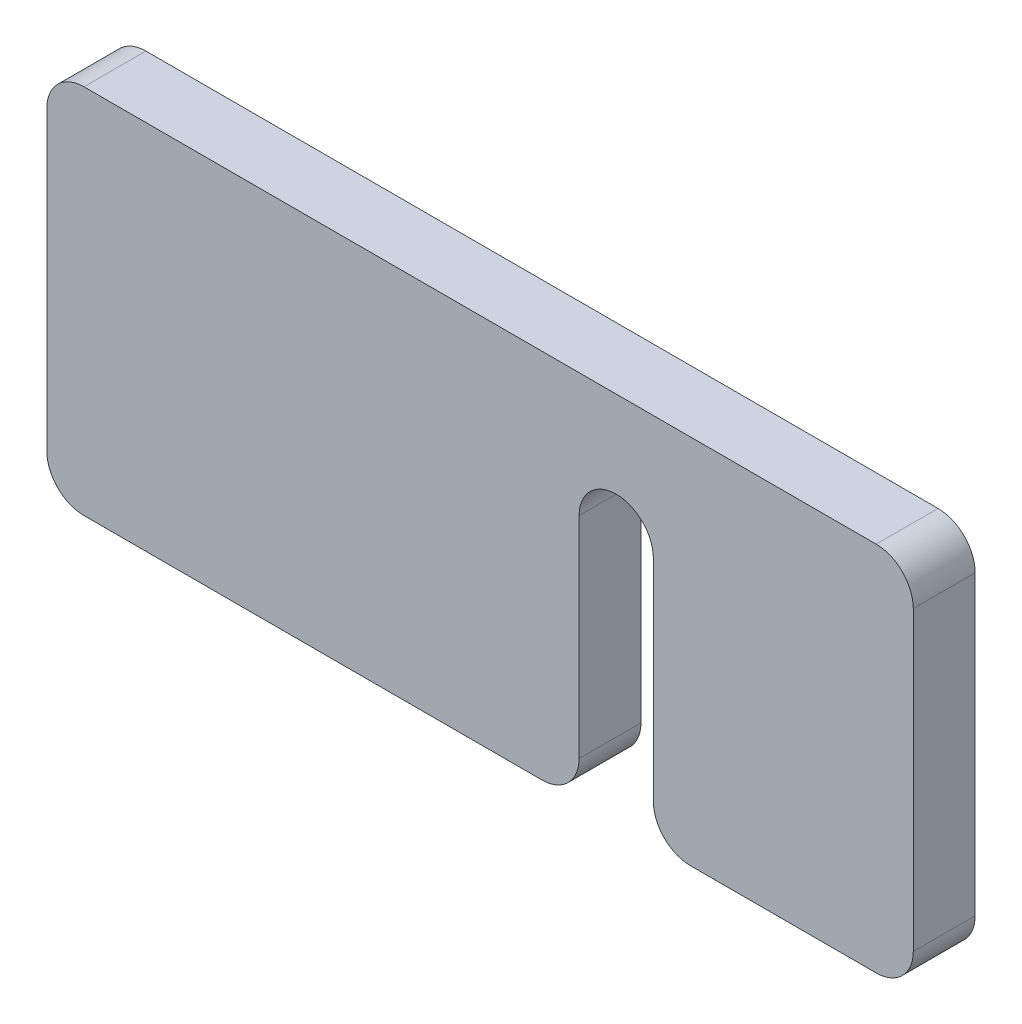
ISO-10303-21;
HEADER;
FILE_DESCRIPTION(('STEP AP214'),'2;1');
FILE_NAME('part.step','',(''),(''),'','','');
FILE_SCHEMA(('AUTOMOTIVE_DESIGN { 1 0 10303 214 1 1 1 1 }'));
ENDSEC;
DATA;
#1=APPLICATION_CONTEXT('core data for automotive mechanical design processes');
#2=APPLICATION_PROTOCOL_DEFINITION('international standard','automotive_design',2000,#1);
#3=PRODUCT_CONTEXT('',#1,'mechanical');
#4=PRODUCT('Part','Part','',(#3));
#5=PRODUCT_RELATED_PRODUCT_CATEGORY('part','',(#4));
#6=PRODUCT_DEFINITION_FORMATION('','',#4);
#7=PRODUCT_DEFINITION_CONTEXT('part definition',#1,'design');
#8=PRODUCT_DEFINITION('design','',#6,#7);
#9=PRODUCT_DEFINITION_SHAPE('','',#8);
#10=(LENGTH_UNIT() NAMED_UNIT(*) SI_UNIT(.MILLI.,.METRE.));
#11=(NAMED_UNIT(*) PLANE_ANGLE_UNIT() SI_UNIT($,.RADIAN.));
#12=(NAMED_UNIT(*) SI_UNIT($,.STERADIAN.) SOLID_ANGLE_UNIT());
#13=UNCERTAINTY_MEASURE_WITH_UNIT(LENGTH_MEASURE(1.E-05),#10,'distance_accuracy_value','');
#14=(GEOMETRIC_REPRESENTATION_CONTEXT(3) GLOBAL_UNCERTAINTY_ASSIGNED_CONTEXT((#13)) GLOBAL_UNIT_ASSIGNED_CONTEXT((#10,
#11,#12)) REPRESENTATION_CONTEXT('',''));
#15=CARTESIAN_POINT('',(0.,0.,0.));
#16=DIRECTION('',(0.,0.,1.));
#17=DIRECTION('',(1.,0.,0.));
#18=AXIS2_PLACEMENT_3D('',#15,#16,#17);
#19=CARTESIAN_POINT('',(35.,-15.,2.5));
#20=DIRECTION('',(0.,1.,0.));
#21=DIRECTION('',(0.,0.,1.));
#22=AXIS2_PLACEMENT_3D('',#19,#20,#21);
#23=PLANE('',#22);
#24=DIRECTION('',(-1.,0.,0.));
#25=VECTOR('',#24,1.);
#26=CARTESIAN_POINT('',(35.,-15.,2.5));
#27=LINE('',#26,#25);
#28=CARTESIAN_POINT('',(32.,-15.,2.5));
#29=VERTEX_POINT('',#28);
#30=CARTESIAN_POINT('',(17.,-15.,2.5));
#31=VERTEX_POINT('',#30);
#32=EDGE_CURVE('E195',#29,#31,#27,.T.);
#33=ORIENTED_EDGE('',*,*,#32,.T.);
#34=DIRECTION('',(0.,0.,-1.));
#35=VECTOR('',#34,1.);
#36=CARTESIAN_POINT('',(17.,-15.,2.5));
#37=LINE('',#36,#35);
#38=CARTESIAN_POINT('',(17.,-15.,-2.5));
#39=VERTEX_POINT('',#38);
#40=EDGE_CURVE('E240',#31,#39,#37,.T.);
#41=ORIENTED_EDGE('',*,*,#40,.T.);
#42=DIRECTION('',(-1.,0.,0.));
#43=VECTOR('',#42,1.);
#44=CARTESIAN_POINT('',(35.,-15.,-2.5));
#45=LINE('',#44,#43);
#46=CARTESIAN_POINT('',(32.,-15.,-2.5));
#47=VERTEX_POINT('',#46);
#48=EDGE_CURVE('E206',#47,#39,#45,.T.);
#49=ORIENTED_EDGE('',*,*,#48,.F.);
#50=DIRECTION('',(0.,0.,-1.));
#51=VECTOR('',#50,1.);
#52=CARTESIAN_POINT('',(32.,-15.,2.5));
#53=LINE('',#52,#51);
#54=EDGE_CURVE('E238',#47,#29,#53,.F.);
#55=ORIENTED_EDGE('',*,*,#54,.T.);
#56=EDGE_LOOP('',(#33,#41,#49,#55));
#57=FACE_BOUND('',#56,.T.);
#58=ADVANCED_FACE('F49',(#57),#23,.F.);
#59=CARTESIAN_POINT('',(5.,-15.,-2.5));
#60=VERTEX_POINT('',#59);
#61=CARTESIAN_POINT('',(-32.,-15.,-2.5));
#62=VERTEX_POINT('',#61);
#63=EDGE_CURVE('E203',#60,#62,#45,.T.);
#64=ORIENTED_EDGE('',*,*,#63,.F.);
#65=DIRECTION('',(0.,0.,-1.));
#66=VECTOR('',#65,1.);
#67=CARTESIAN_POINT('',(5.,-15.,2.5));
#68=LINE('',#67,#66);
#69=CARTESIAN_POINT('',(5.,-15.,2.5));
#70=VERTEX_POINT('',#69);
#71=EDGE_CURVE('E225',#60,#70,#68,.F.);
#72=ORIENTED_EDGE('',*,*,#71,.T.);
#73=CARTESIAN_POINT('',(-32.,-15.,2.5));
#74=VERTEX_POINT('',#73);
#75=EDGE_CURVE('E191',#70,#74,#27,.T.);
#76=ORIENTED_EDGE('',*,*,#75,.T.);
#77=DIRECTION('',(0.,0.,-1.));
#78=VECTOR('',#77,1.);
#79=CARTESIAN_POINT('',(-32.,-15.,2.5));
#80=LINE('',#79,#78);
#81=EDGE_CURVE('E222',#74,#62,#80,.T.);
#82=ORIENTED_EDGE('',*,*,#81,.T.);
#83=EDGE_LOOP('',(#64,#72,#76,#82));
#84=FACE_BOUND('',#83,.T.);
#85=ADVANCED_FACE('F294',(#84),#23,.F.);
#86=CARTESIAN_POINT('',(35.,-15.,-2.5));
#87=DIRECTION('',(0.,0.,1.));
#88=DIRECTION('',(1.,0.,0.));
#89=AXIS2_PLACEMENT_3D('',#86,#87,#88);
#90=PLANE('',#89);
#91=DIRECTION('',(0.,1.,0.));
#92=VECTOR('',#91,1.);
#93=CARTESIAN_POINT('',(8.,-15.,-2.5));
#94=LINE('',#93,#92);
#95=CARTESIAN_POINT('',(8.,-12.,-2.5));
#96=VERTEX_POINT('',#95);
#97=CARTESIAN_POINT('',(8.,5.,-2.5));
#98=VERTEX_POINT('',#97);
#99=EDGE_CURVE('E181',#96,#98,#94,.T.);
#100=ORIENTED_EDGE('',*,*,#99,.F.);
#101=CARTESIAN_POINT('',(5.,-12.,-2.5));
#102=DIRECTION('',(0.,0.,1.));
#103=DIRECTION('',(1.,0.,0.));
#104=AXIS2_PLACEMENT_3D('',#101,#102,#103);
#105=CIRCLE('',#104,3.);
#106=EDGE_CURVE('E220',#96,#60,#105,.F.);
#107=ORIENTED_EDGE('',*,*,#106,.T.);
#108=ORIENTED_EDGE('',*,*,#63,.T.);
#109=CARTESIAN_POINT('',(-32.,-12.,-2.5));
#110=DIRECTION('',(0.,0.,1.));
#111=DIRECTION('',(1.,0.,0.));
#112=AXIS2_PLACEMENT_3D('',#109,#110,#111);
#113=CIRCLE('',#112,3.);
#114=CARTESIAN_POINT('',(-35.,-12.,-2.5));
#115=VERTEX_POINT('',#114);
#116=EDGE_CURVE('E210',#62,#115,#113,.F.);
#117=ORIENTED_EDGE('',*,*,#116,.T.);
#118=DIRECTION('',(0.,1.,0.));
#119=VECTOR('',#118,1.);
#120=CARTESIAN_POINT('',(-35.,-15.,-2.5));
#121=LINE('',#120,#119);
#122=CARTESIAN_POINT('',(-35.,12.,-2.5));
#123=VERTEX_POINT('',#122);
#124=EDGE_CURVE('E161',#115,#123,#121,.T.);
#125=ORIENTED_EDGE('',*,*,#124,.T.);
#126=CARTESIAN_POINT('',(-32.,12.,-2.5));
#127=DIRECTION('',(0.,0.,1.));
#128=DIRECTION('',(1.,0.,0.));
#129=AXIS2_PLACEMENT_3D('',#126,#127,#128);
#130=CIRCLE('',#129,3.);
#131=CARTESIAN_POINT('',(-32.,15.,-2.5));
#132=VERTEX_POINT('',#131);
#133=EDGE_CURVE('E212',#123,#132,#130,.F.);
#134=ORIENTED_EDGE('',*,*,#133,.T.);
#135=DIRECTION('',(-1.,0.,0.));
#136=VECTOR('',#135,1.);
#137=CARTESIAN_POINT('',(35.,15.,-2.5));
#138=LINE('',#137,#136);
#139=CARTESIAN_POINT('',(32.,15.,-2.5));
#140=VERTEX_POINT('',#139);
#141=EDGE_CURVE('E200',#140,#132,#138,.T.);
#142=ORIENTED_EDGE('',*,*,#141,.F.);
#143=CARTESIAN_POINT('',(32.,12.,-2.5));
#144=DIRECTION('',(0.,0.,1.));
#145=DIRECTION('',(1.,0.,0.));
#146=AXIS2_PLACEMENT_3D('',#143,#144,#145);
#147=CIRCLE('',#146,3.);
#148=CARTESIAN_POINT('',(35.,12.,-2.5));
#149=VERTEX_POINT('',#148);
#150=EDGE_CURVE('E214',#140,#149,#147,.F.);
#151=ORIENTED_EDGE('',*,*,#150,.T.);
#152=DIRECTION('',(0.,1.,0.));
#153=VECTOR('',#152,1.);
#154=CARTESIAN_POINT('',(35.,-15.,-2.5));
#155=LINE('',#154,#153);
#156=CARTESIAN_POINT('',(35.,-12.,-2.5));
#157=VERTEX_POINT('',#156);
#158=EDGE_CURVE('E184',#157,#149,#155,.T.);
#159=ORIENTED_EDGE('',*,*,#158,.F.);
#160=CARTESIAN_POINT('',(32.,-12.,-2.5));
#161=DIRECTION('',(0.,0.,1.));
#162=DIRECTION('',(1.,0.,0.));
#163=AXIS2_PLACEMENT_3D('',#160,#161,#162);
#164=CIRCLE('',#163,3.);
#165=EDGE_CURVE('E216',#157,#47,#164,.F.);
#166=ORIENTED_EDGE('',*,*,#165,.T.);
#167=ORIENTED_EDGE('',*,*,#48,.T.);
#168=CARTESIAN_POINT('',(17.,-12.,-2.5));
#169=DIRECTION('',(0.,0.,1.));
#170=DIRECTION('',(1.,0.,0.));
#171=AXIS2_PLACEMENT_3D('',#168,#169,#170);
#172=CIRCLE('',#171,3.);
#173=CARTESIAN_POINT('',(14.,-12.,-2.5));
#174=VERTEX_POINT('',#173);
#175=EDGE_CURVE('E218',#39,#174,#172,.F.);
#176=ORIENTED_EDGE('',*,*,#175,.T.);
#177=DIRECTION('',(0.,-1.,0.));
#178=VECTOR('',#177,1.);
#179=CARTESIAN_POINT('',(14.,-15.,-2.5));
#180=LINE('',#179,#178);
#181=CARTESIAN_POINT('',(14.,5.,-2.5));
#182=VERTEX_POINT('',#181);
#183=EDGE_CURVE('E179',#182,#174,#180,.T.);
#184=ORIENTED_EDGE('',*,*,#183,.F.);
#185=CARTESIAN_POINT('',(11.,5.,-2.5));
#186=DIRECTION('',(0.,0.,-1.));
#187=DIRECTION('',(1.,0.,0.));
#188=AXIS2_PLACEMENT_3D('',#185,#186,#187);
#189=CIRCLE('',#188,3.);
#190=EDGE_CURVE('E157',#98,#182,#189,.T.);
#191=ORIENTED_EDGE('',*,*,#190,.F.);
#192=EDGE_LOOP('',(#100,#107,#108,#117,#125,#134,#142,#151,#159,#166,#167,#176,#184,#191));
#193=FACE_BOUND('',#192,.T.);
#194=ADVANCED_FACE('F264',(#193),#90,.F.);
#195=CARTESIAN_POINT('',(35.,15.,2.5));
#196=DIRECTION('',(0.,-1.,0.));
#197=DIRECTION('',(0.,0.,-1.));
#198=AXIS2_PLACEMENT_3D('',#195,#196,#197);
#199=PLANE('',#198);
#200=DIRECTION('',(-1.,0.,0.));
#201=VECTOR('',#200,1.);
#202=CARTESIAN_POINT('',(35.,15.,2.5));
#203=LINE('',#202,#201);
#204=CARTESIAN_POINT('',(32.,15.,2.5));
#205=VERTEX_POINT('',#204);
#206=CARTESIAN_POINT('',(-32.,15.,2.5));
#207=VERTEX_POINT('',#206);
#208=EDGE_CURVE('E198',#205,#207,#203,.T.);
#209=ORIENTED_EDGE('',*,*,#208,.F.);
#210=DIRECTION('',(0.,0.,1.));
#211=VECTOR('',#210,1.);
#212=CARTESIAN_POINT('',(32.,15.,-2.5));
#213=LINE('',#212,#211);
#214=EDGE_CURVE('E253',#205,#140,#213,.F.);
#215=ORIENTED_EDGE('',*,*,#214,.T.);
#216=ORIENTED_EDGE('',*,*,#141,.T.);
#217=DIRECTION('',(0.,0.,1.));
#218=VECTOR('',#217,1.);
#219=CARTESIAN_POINT('',(-32.,15.,2.5));
#220=LINE('',#219,#218);
#221=EDGE_CURVE('E250',#132,#207,#220,.T.);
#222=ORIENTED_EDGE('',*,*,#221,.T.);
#223=EDGE_LOOP('',(#209,#215,#216,#222));
#224=FACE_BOUND('',#223,.T.);
#225=ADVANCED_FACE('F258',(#224),#199,.F.);
#226=CARTESIAN_POINT('',(35.,-15.,2.5));
#227=DIRECTION('',(0.,0.,-1.));
#228=DIRECTION('',(-1.,0.,0.));
#229=AXIS2_PLACEMENT_3D('',#226,#227,#228);
#230=PLANE('',#229);
#231=ORIENTED_EDGE('',*,*,#75,.F.);
#232=CARTESIAN_POINT('',(5.,-12.,2.5));
#233=DIRECTION('',(0.,0.,-1.));
#234=DIRECTION('',(-1.,0.,0.));
#235=AXIS2_PLACEMENT_3D('',#232,#233,#234);
#236=CIRCLE('',#235,3.);
#237=CARTESIAN_POINT('',(8.,-12.,2.5));
#238=VERTEX_POINT('',#237);
#239=EDGE_CURVE('E236',#70,#238,#236,.F.);
#240=ORIENTED_EDGE('',*,*,#239,.T.);
#241=DIRECTION('',(0.,1.,0.));
#242=VECTOR('',#241,1.);
#243=CARTESIAN_POINT('',(8.,-15.,2.5));
#244=LINE('',#243,#242);
#245=CARTESIAN_POINT('',(8.,5.,2.5));
#246=VERTEX_POINT('',#245);
#247=EDGE_CURVE('E170',#238,#246,#244,.T.);
#248=ORIENTED_EDGE('',*,*,#247,.T.);
#249=CARTESIAN_POINT('',(11.,5.,2.5));
#250=DIRECTION('',(0.,0.,-1.));
#251=DIRECTION('',(1.,0.,0.));
#252=AXIS2_PLACEMENT_3D('',#249,#250,#251);
#253=CIRCLE('',#252,3.);
#254=CARTESIAN_POINT('',(14.,5.,2.5));
#255=VERTEX_POINT('',#254);
#256=EDGE_CURVE('E154',#246,#255,#253,.T.);
#257=ORIENTED_EDGE('',*,*,#256,.T.);
#258=DIRECTION('',(0.,-1.,0.));
#259=VECTOR('',#258,1.);
#260=CARTESIAN_POINT('',(14.,-15.,2.5));
#261=LINE('',#260,#259);
#262=CARTESIAN_POINT('',(14.,-12.,2.5));
#263=VERTEX_POINT('',#262);
#264=EDGE_CURVE('E165',#255,#263,#261,.T.);
#265=ORIENTED_EDGE('',*,*,#264,.T.);
#266=CARTESIAN_POINT('',(17.,-12.,2.5));
#267=DIRECTION('',(0.,0.,-1.));
#268=DIRECTION('',(-1.,0.,0.));
#269=AXIS2_PLACEMENT_3D('',#266,#267,#268);
#270=CIRCLE('',#269,3.);
#271=EDGE_CURVE('E234',#263,#31,#270,.F.);
#272=ORIENTED_EDGE('',*,*,#271,.T.);
#273=ORIENTED_EDGE('',*,*,#32,.F.);
#274=CARTESIAN_POINT('',(32.,-12.,2.5));
#275=DIRECTION('',(0.,0.,-1.));
#276=DIRECTION('',(-1.,0.,0.));
#277=AXIS2_PLACEMENT_3D('',#274,#275,#276);
#278=CIRCLE('',#277,3.);
#279=CARTESIAN_POINT('',(35.,-12.,2.5));
#280=VERTEX_POINT('',#279);
#281=EDGE_CURVE('E232',#29,#280,#278,.F.);
#282=ORIENTED_EDGE('',*,*,#281,.T.);
#283=DIRECTION('',(0.,-1.,0.));
#284=VECTOR('',#283,1.);
#285=CARTESIAN_POINT('',(35.,-15.,2.5));
#286=LINE('',#285,#284);
#287=CARTESIAN_POINT('',(35.,12.,2.5));
#288=VERTEX_POINT('',#287);
#289=EDGE_CURVE('E187',#288,#280,#286,.T.);
#290=ORIENTED_EDGE('',*,*,#289,.F.);
#291=CARTESIAN_POINT('',(32.,12.,2.5));
#292=DIRECTION('',(0.,0.,-1.));
#293=DIRECTION('',(-1.,0.,0.));
#294=AXIS2_PLACEMENT_3D('',#291,#292,#293);
#295=CIRCLE('',#294,3.);
#296=EDGE_CURVE('E230',#288,#205,#295,.F.);
#297=ORIENTED_EDGE('',*,*,#296,.T.);
#298=ORIENTED_EDGE('',*,*,#208,.T.);
#299=CARTESIAN_POINT('',(-32.,12.,2.5));
#300=DIRECTION('',(0.,0.,-1.));
#301=DIRECTION('',(-1.,0.,0.));
#302=AXIS2_PLACEMENT_3D('',#299,#300,#301);
#303=CIRCLE('',#302,3.);
#304=CARTESIAN_POINT('',(-35.,12.,2.5));
#305=VERTEX_POINT('',#304);
#306=EDGE_CURVE('E70',#207,#305,#303,.F.);
#307=ORIENTED_EDGE('',*,*,#306,.T.);
#308=DIRECTION('',(0.,-1.,0.));
#309=VECTOR('',#308,1.);
#310=CARTESIAN_POINT('',(-35.,-15.,2.5));
#311=LINE('',#310,#309);
#312=CARTESIAN_POINT('',(-35.,-12.,2.5));
#313=VERTEX_POINT('',#312);
#314=EDGE_CURVE('E188',#305,#313,#311,.T.);
#315=ORIENTED_EDGE('',*,*,#314,.T.);
#316=CARTESIAN_POINT('',(-32.,-12.,2.5));
#317=DIRECTION('',(0.,0.,-1.));
#318=DIRECTION('',(-1.,0.,0.));
#319=AXIS2_PLACEMENT_3D('',#316,#317,#318);
#320=CIRCLE('',#319,3.);
#321=EDGE_CURVE('E227',#313,#74,#320,.F.);
#322=ORIENTED_EDGE('',*,*,#321,.T.);
#323=EDGE_LOOP('',(#231,#240,#248,#257,#265,#272,#273,#282,#290,#297,#298,#307,#315,#322));
#324=FACE_BOUND('',#323,.T.);
#325=ADVANCED_FACE('F173',(#324),#230,.F.);
#326=CARTESIAN_POINT('',(35.,-15.,-2.5));
#327=DIRECTION('',(1.,0.,0.));
#328=DIRECTION('',(0.,0.,-1.));
#329=AXIS2_PLACEMENT_3D('',#326,#327,#328);
#330=PLANE('',#329);
#331=ORIENTED_EDGE('',*,*,#289,.T.);
#332=DIRECTION('',(0.,0.,-1.));
#333=VECTOR('',#332,1.);
#334=CARTESIAN_POINT('',(35.,-12.,-2.5));
#335=LINE('',#334,#333);
#336=EDGE_CURVE('E247',#280,#157,#335,.T.);
#337=ORIENTED_EDGE('',*,*,#336,.T.);
#338=ORIENTED_EDGE('',*,*,#158,.T.);
#339=DIRECTION('',(0.,0.,1.));
#340=VECTOR('',#339,1.);
#341=CARTESIAN_POINT('',(35.,12.,2.5));
#342=LINE('',#341,#340);
#343=EDGE_CURVE('E244',#149,#288,#342,.T.);
#344=ORIENTED_EDGE('',*,*,#343,.T.);
#345=EDGE_LOOP('',(#331,#337,#338,#344));
#346=FACE_BOUND('',#345,.T.);
#347=ADVANCED_FACE('F271',(#346),#330,.T.);
#348=CARTESIAN_POINT('',(-35.,-15.,-2.5));
#349=DIRECTION('',(1.,0.,0.));
#350=DIRECTION('',(0.,0.,-1.));
#351=AXIS2_PLACEMENT_3D('',#348,#349,#350);
#352=PLANE('',#351);
#353=ORIENTED_EDGE('',*,*,#314,.F.);
#354=DIRECTION('',(0.,0.,1.));
#355=VECTOR('',#354,1.);
#356=CARTESIAN_POINT('',(-35.,12.,-2.5));
#357=LINE('',#356,#355);
#358=EDGE_CURVE('E12',#305,#123,#357,.F.);
#359=ORIENTED_EDGE('',*,*,#358,.T.);
#360=ORIENTED_EDGE('',*,*,#124,.F.);
#361=DIRECTION('',(0.,0.,-1.));
#362=VECTOR('',#361,1.);
#363=CARTESIAN_POINT('',(-35.,-12.,-2.5));
#364=LINE('',#363,#362);
#365=EDGE_CURVE('E57',#115,#313,#364,.F.);
#366=ORIENTED_EDGE('',*,*,#365,.T.);
#367=EDGE_LOOP('',(#353,#359,#360,#366));
#368=FACE_BOUND('',#367,.T.);
#369=ADVANCED_FACE('F298',(#368),#352,.F.);
#370=CARTESIAN_POINT('',(14.,-15.,2.5));
#371=DIRECTION('',(1.,0.,0.));
#372=DIRECTION('',(0.,0.,-1.));
#373=AXIS2_PLACEMENT_3D('',#370,#371,#372);
#374=PLANE('',#373);
#375=ORIENTED_EDGE('',*,*,#183,.T.);
#376=DIRECTION('',(0.,0.,-1.));
#377=VECTOR('',#376,1.);
#378=CARTESIAN_POINT('',(14.,-12.,2.5));
#379=LINE('',#378,#377);
#380=EDGE_CURVE('E168',#174,#263,#379,.F.);
#381=ORIENTED_EDGE('',*,*,#380,.T.);
#382=ORIENTED_EDGE('',*,*,#264,.F.);
#383=DIRECTION('',(0.,0.,-1.));
#384=VECTOR('',#383,1.);
#385=CARTESIAN_POINT('',(14.,5.,2.5));
#386=LINE('',#385,#384);
#387=EDGE_CURVE('E149',#255,#182,#386,.T.);
#388=ORIENTED_EDGE('',*,*,#387,.T.);
#389=EDGE_LOOP('',(#375,#381,#382,#388));
#390=FACE_BOUND('',#389,.T.);
#391=ADVANCED_FACE('F166',(#390),#374,.F.);
#392=CARTESIAN_POINT('',(11.,5.,2.5));
#393=DIRECTION('',(0.,0.,-1.));
#394=DIRECTION('',(-1.,0.,0.));
#395=AXIS2_PLACEMENT_3D('',#392,#393,#394);
#396=CYLINDRICAL_SURFACE('',#395,3.);
#397=ORIENTED_EDGE('',*,*,#190,.T.);
#398=ORIENTED_EDGE('',*,*,#387,.F.);
#399=ORIENTED_EDGE('',*,*,#256,.F.);
#400=DIRECTION('',(0.,0.,-1.));
#401=VECTOR('',#400,1.);
#402=CARTESIAN_POINT('',(8.,5.,2.5));
#403=LINE('',#402,#401);
#404=EDGE_CURVE('E162',#246,#98,#403,.T.);
#405=ORIENTED_EDGE('',*,*,#404,.T.);
#406=EDGE_LOOP('',(#397,#398,#399,#405));
#407=FACE_BOUND('',#406,.T.);
#408=ADVANCED_FACE('F151',(#407),#396,.F.);
#409=CARTESIAN_POINT('',(8.,-15.,2.5));
#410=DIRECTION('',(-1.,0.,0.));
#411=DIRECTION('',(0.,-1.,0.));
#412=AXIS2_PLACEMENT_3D('',#409,#410,#411);
#413=PLANE('',#412);
#414=ORIENTED_EDGE('',*,*,#247,.F.);
#415=DIRECTION('',(0.,0.,-1.));
#416=VECTOR('',#415,1.);
#417=CARTESIAN_POINT('',(8.,-12.,2.5));
#418=LINE('',#417,#416);
#419=EDGE_CURVE('E207',#238,#96,#418,.T.);
#420=ORIENTED_EDGE('',*,*,#419,.T.);
#421=ORIENTED_EDGE('',*,*,#99,.T.);
#422=ORIENTED_EDGE('',*,*,#404,.F.);
#423=EDGE_LOOP('',(#414,#420,#421,#422));
#424=FACE_BOUND('',#423,.T.);
#425=ADVANCED_FACE('F286',(#424),#413,.F.);
#426=CARTESIAN_POINT('',(5.,-12.,2.5));
#427=DIRECTION('',(0.,0.,-1.));
#428=DIRECTION('',(-1.,0.,0.));
#429=AXIS2_PLACEMENT_3D('',#426,#427,#428);
#430=CYLINDRICAL_SURFACE('',#429,3.);
#431=ORIENTED_EDGE('',*,*,#239,.F.);
#432=ORIENTED_EDGE('',*,*,#71,.F.);
#433=ORIENTED_EDGE('',*,*,#106,.F.);
#434=ORIENTED_EDGE('',*,*,#419,.F.);
#435=EDGE_LOOP('',(#431,#432,#433,#434));
#436=FACE_BOUND('',#435,.T.);
#437=ADVANCED_FACE('F290',(#436),#430,.T.);
#438=CARTESIAN_POINT('',(17.,-12.,2.5));
#439=DIRECTION('',(0.,0.,-1.));
#440=DIRECTION('',(-1.,0.,0.));
#441=AXIS2_PLACEMENT_3D('',#438,#439,#440);
#442=CYLINDRICAL_SURFACE('',#441,3.);
#443=ORIENTED_EDGE('',*,*,#271,.F.);
#444=ORIENTED_EDGE('',*,*,#380,.F.);
#445=ORIENTED_EDGE('',*,*,#175,.F.);
#446=ORIENTED_EDGE('',*,*,#40,.F.);
#447=EDGE_LOOP('',(#443,#444,#445,#446));
#448=FACE_BOUND('',#447,.T.);
#449=ADVANCED_FACE('F283',(#448),#442,.T.);
#450=CARTESIAN_POINT('',(32.,-12.,-2.5));
#451=DIRECTION('',(0.,0.,1.));
#452=DIRECTION('',(1.,0.,0.));
#453=AXIS2_PLACEMENT_3D('',#450,#451,#452);
#454=CYLINDRICAL_SURFACE('',#453,3.);
#455=ORIENTED_EDGE('',*,*,#281,.F.);
#456=ORIENTED_EDGE('',*,*,#54,.F.);
#457=ORIENTED_EDGE('',*,*,#165,.F.);
#458=ORIENTED_EDGE('',*,*,#336,.F.);
#459=EDGE_LOOP('',(#455,#456,#457,#458));
#460=FACE_BOUND('',#459,.T.);
#461=ADVANCED_FACE('F277',(#460),#454,.T.);
#462=CARTESIAN_POINT('',(32.,12.,-2.5));
#463=DIRECTION('',(0.,0.,-1.));
#464=DIRECTION('',(-1.,0.,0.));
#465=AXIS2_PLACEMENT_3D('',#462,#463,#464);
#466=CYLINDRICAL_SURFACE('',#465,3.);
#467=ORIENTED_EDGE('',*,*,#150,.F.);
#468=ORIENTED_EDGE('',*,*,#214,.F.);
#469=ORIENTED_EDGE('',*,*,#296,.F.);
#470=ORIENTED_EDGE('',*,*,#343,.F.);
#471=EDGE_LOOP('',(#467,#468,#469,#470));
#472=FACE_BOUND('',#471,.T.);
#473=ADVANCED_FACE('F268',(#472),#466,.T.);
#474=CARTESIAN_POINT('',(-32.,12.,2.5));
#475=DIRECTION('',(0.,0.,1.));
#476=DIRECTION('',(1.,0.,0.));
#477=AXIS2_PLACEMENT_3D('',#474,#475,#476);
#478=CYLINDRICAL_SURFACE('',#477,3.);
#479=ORIENTED_EDGE('',*,*,#133,.F.);
#480=ORIENTED_EDGE('',*,*,#358,.F.);
#481=ORIENTED_EDGE('',*,*,#306,.F.);
#482=ORIENTED_EDGE('',*,*,#221,.F.);
#483=EDGE_LOOP('',(#479,#480,#481,#482));
#484=FACE_BOUND('',#483,.T.);
#485=ADVANCED_FACE('F301',(#484),#478,.T.);
#486=CARTESIAN_POINT('',(-32.,-12.,2.5));
#487=DIRECTION('',(0.,0.,-1.));
#488=DIRECTION('',(-1.,0.,0.));
#489=AXIS2_PLACEMENT_3D('',#486,#487,#488);
#490=CYLINDRICAL_SURFACE('',#489,3.);
#491=ORIENTED_EDGE('',*,*,#321,.F.);
#492=ORIENTED_EDGE('',*,*,#365,.F.);
#493=ORIENTED_EDGE('',*,*,#116,.F.);
#494=ORIENTED_EDGE('',*,*,#81,.F.);
#495=EDGE_LOOP('',(#491,#492,#493,#494));
#496=FACE_BOUND('',#495,.T.);
#497=ADVANCED_FACE('F51',(#496),#490,.T.);
#498=CLOSED_SHELL('',(#58,#85,#194,#225,#325,#347,#369,#391,#408,#425,#437,#449,#461,#473,#485,#497));
#499=MANIFOLD_SOLID_BREP('B2',#498);
#500=ADVANCED_BREP_SHAPE_REPRESENTATION('',(#18,#499),#14);
#501=SHAPE_DEFINITION_REPRESENTATION(#9,#500);
ENDSEC;
END-ISO-10303-21;
